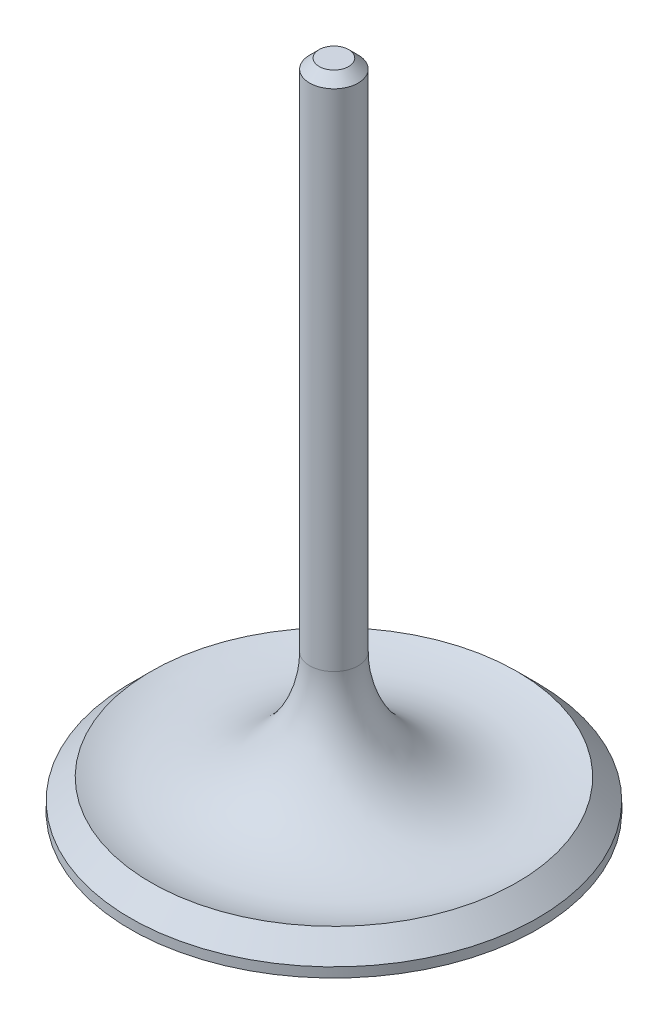
ISO-10303-21;
HEADER;
FILE_DESCRIPTION(('STEP AP214'),'2;1');
FILE_NAME('part.step','',(''),(''),'','','');
FILE_SCHEMA(('AUTOMOTIVE_DESIGN { 1 0 10303 214 1 1 1 1 }'));
ENDSEC;
DATA;
#1=APPLICATION_CONTEXT('core data for automotive mechanical design processes');
#2=APPLICATION_PROTOCOL_DEFINITION('international standard','automotive_design',2000,#1);
#3=PRODUCT_CONTEXT('',#1,'mechanical');
#4=PRODUCT('Part','Part','',(#3));
#5=PRODUCT_RELATED_PRODUCT_CATEGORY('part','',(#4));
#6=PRODUCT_DEFINITION_FORMATION('','',#4);
#7=PRODUCT_DEFINITION_CONTEXT('part definition',#1,'design');
#8=PRODUCT_DEFINITION('design','',#6,#7);
#9=PRODUCT_DEFINITION_SHAPE('','',#8);
#10=(LENGTH_UNIT() NAMED_UNIT(*) SI_UNIT(.MILLI.,.METRE.));
#11=(NAMED_UNIT(*) PLANE_ANGLE_UNIT() SI_UNIT($,.RADIAN.));
#12=(NAMED_UNIT(*) SI_UNIT($,.STERADIAN.) SOLID_ANGLE_UNIT());
#13=UNCERTAINTY_MEASURE_WITH_UNIT(LENGTH_MEASURE(1.E-05),#10,'distance_accuracy_value','');
#14=(GEOMETRIC_REPRESENTATION_CONTEXT(3) GLOBAL_UNCERTAINTY_ASSIGNED_CONTEXT((#13)) GLOBAL_UNIT_ASSIGNED_CONTEXT((#10,
#11,#12)) REPRESENTATION_CONTEXT('',''));
#15=CARTESIAN_POINT('',(0.,0.,0.));
#16=DIRECTION('',(0.,0.,1.));
#17=DIRECTION('',(1.,0.,0.));
#18=AXIS2_PLACEMENT_3D('',#15,#16,#17);
#19=CARTESIAN_POINT('',(0.,0.,-26.67));
#20=DIRECTION('',(0.,-1.,0.));
#21=DIRECTION('',(0.,0.,-1.));
#22=AXIS2_PLACEMENT_3D('',#19,#20,#21);
#23=PLANE('',#22);
#24=CARTESIAN_POINT('',(0.,0.,0.));
#25=DIRECTION('',(0.,-1.,0.));
#26=DIRECTION('',(0.,0.,-1.));
#27=AXIS2_PLACEMENT_3D('',#24,#25,#26);
#28=CIRCLE('',#27,26.67);
#29=CARTESIAN_POINT('',(0.,0.,-26.67));
#30=VERTEX_POINT('',#29);
#31=EDGE_CURVE('E57',#30,#30,#28,.T.);
#32=ORIENTED_EDGE('',*,*,#31,.T.);
#33=EDGE_LOOP('',(#32));
#34=FACE_BOUND('',#33,.T.);
#35=ADVANCED_FACE('F43',(#34),#23,.T.);
#36=CARTESIAN_POINT('',(0.,0.,0.));
#37=DIRECTION('',(0.,-1.,0.));
#38=DIRECTION('',(0.,0.,-1.));
#39=AXIS2_PLACEMENT_3D('',#36,#37,#38);
#40=CYLINDRICAL_SURFACE('',#39,26.67);
#41=CARTESIAN_POINT('',(0.,1.27,0.));
#42=DIRECTION('',(0.,-1.,0.));
#43=DIRECTION('',(0.,0.,-1.));
#44=AXIS2_PLACEMENT_3D('',#41,#42,#43);
#45=CIRCLE('',#44,26.67);
#46=CARTESIAN_POINT('',(0.,1.27,-26.67));
#47=VERTEX_POINT('',#46);
#48=EDGE_CURVE('E62',#47,#47,#45,.T.);
#49=ORIENTED_EDGE('',*,*,#48,.T.);
#50=EDGE_LOOP('',(#49));
#51=FACE_BOUND('',#50,.T.);
#52=ORIENTED_EDGE('',*,*,#31,.F.);
#53=EDGE_LOOP('',(#52));
#54=FACE_BOUND('',#53,.T.);
#55=ADVANCED_FACE('F92',(#51,#54),#40,.T.);
#56=CARTESIAN_POINT('',(0.,1.27,0.));
#57=DIRECTION('',(0.,-1.,0.));
#58=DIRECTION('',(0.,0.,-1.));
#59=AXIS2_PLACEMENT_3D('',#56,#57,#58);
#60=CONICAL_SURFACE('',#59,26.67,0.785398163397456);
#61=CARTESIAN_POINT('',(0.,3.96407683632073,0.));
#62=DIRECTION('',(0.,-1.,0.));
#63=DIRECTION('',(0.,0.,-1.));
#64=AXIS2_PLACEMENT_3D('',#61,#62,#63);
#65=CIRCLE('',#64,23.9759231636792);
#66=CARTESIAN_POINT('',(0.,3.96407683632073,-23.9759231636792));
#67=VERTEX_POINT('',#66);
#68=EDGE_CURVE('E68',#67,#67,#65,.T.);
#69=ORIENTED_EDGE('',*,*,#68,.T.);
#70=EDGE_LOOP('',(#69));
#71=FACE_BOUND('',#70,.T.);
#72=ORIENTED_EDGE('',*,*,#48,.F.);
#73=EDGE_LOOP('',(#72));
#74=FACE_BOUND('',#73,.T.);
#75=ADVANCED_FACE('F89',(#71,#74),#60,.T.);
#76=CARTESIAN_POINT('',(0.,18.1698938231246,0.));
#77=DIRECTION('',(0.,-1.,0.));
#78=DIRECTION('',(0.,0.,-1.));
#79=AXIS2_PLACEMENT_3D('',#76,#77,#78);
#80=TOROIDAL_SURFACE('',#79,18.43,15.25);
#81=CARTESIAN_POINT('',(0.,18.1698938231246,0.));
#82=DIRECTION('',(0.,-1.,0.));
#83=DIRECTION('',(0.,0.,-1.));
#84=AXIS2_PLACEMENT_3D('',#81,#82,#83);
#85=CIRCLE('',#84,3.18000000000001);
#86=CARTESIAN_POINT('',(0.,18.1698938231246,-3.18000000000001));
#87=VERTEX_POINT('',#86);
#88=EDGE_CURVE('E72',#87,#87,#85,.T.);
#89=ORIENTED_EDGE('',*,*,#88,.T.);
#90=EDGE_LOOP('',(#89));
#91=FACE_BOUND('',#90,.T.);
#92=ORIENTED_EDGE('',*,*,#68,.F.);
#93=EDGE_LOOP('',(#92));
#94=FACE_BOUND('',#93,.T.);
#95=ADVANCED_FACE('F77',(#91,#94),#80,.F.);
#96=CARTESIAN_POINT('',(0.,0.,0.));
#97=DIRECTION('',(0.,-1.,0.));
#98=DIRECTION('',(0.,0.,-1.));
#99=AXIS2_PLACEMENT_3D('',#96,#97,#98);
#100=CYLINDRICAL_SURFACE('',#99,3.18000000000001);
#101=CARTESIAN_POINT('',(0.,84.3,0.));
#102=DIRECTION('',(0.,1.,0.));
#103=DIRECTION('',(0.,0.,1.));
#104=AXIS2_PLACEMENT_3D('',#101,#102,#103);
#105=CIRCLE('',#104,3.18000000000001);
#106=CARTESIAN_POINT('',(0.,84.3,3.18000000000001));
#107=VERTEX_POINT('',#106);
#108=EDGE_CURVE('E52',#107,#107,#105,.F.);
#109=ORIENTED_EDGE('',*,*,#108,.T.);
#110=EDGE_LOOP('',(#109));
#111=FACE_BOUND('',#110,.T.);
#112=ORIENTED_EDGE('',*,*,#88,.F.);
#113=EDGE_LOOP('',(#112));
#114=FACE_BOUND('',#113,.T.);
#115=ADVANCED_FACE('F80',(#111,#114),#100,.T.);
#116=CARTESIAN_POINT('',(0.,85.55,0.));
#117=DIRECTION('',(0.,1.,0.));
#118=DIRECTION('',(0.,0.,1.));
#119=AXIS2_PLACEMENT_3D('',#116,#117,#118);
#120=PLANE('',#119);
#121=CARTESIAN_POINT('',(0.,85.55,0.));
#122=DIRECTION('',(0.,1.,0.));
#123=DIRECTION('',(0.,0.,1.));
#124=AXIS2_PLACEMENT_3D('',#121,#122,#123);
#125=CIRCLE('',#124,1.93000000000002);
#126=CARTESIAN_POINT('',(0.,85.55,1.93000000000002));
#127=VERTEX_POINT('',#126);
#128=EDGE_CURVE('E10',#127,#127,#125,.T.);
#129=ORIENTED_EDGE('',*,*,#128,.T.);
#130=EDGE_LOOP('',(#129));
#131=FACE_BOUND('',#130,.T.);
#132=ADVANCED_FACE('F82',(#131),#120,.T.);
#133=CARTESIAN_POINT('',(0.,84.3,0.));
#134=DIRECTION('',(0.,-1.,0.));
#135=DIRECTION('',(0.,0.,-1.));
#136=AXIS2_PLACEMENT_3D('',#133,#134,#135);
#137=CONICAL_SURFACE('',#136,3.18000000000001,0.785398163397444);
#138=ORIENTED_EDGE('',*,*,#128,.F.);
#139=EDGE_LOOP('',(#138));
#140=FACE_BOUND('',#139,.T.);
#141=ORIENTED_EDGE('',*,*,#108,.F.);
#142=EDGE_LOOP('',(#141));
#143=FACE_BOUND('',#142,.T.);
#144=ADVANCED_FACE('F46',(#140,#143),#137,.T.);
#145=CLOSED_SHELL('',(#35,#55,#75,#95,#115,#132,#144));
#146=MANIFOLD_SOLID_BREP('B2',#145);
#147=ADVANCED_BREP_SHAPE_REPRESENTATION('',(#18,#146),#14);
#148=SHAPE_DEFINITION_REPRESENTATION(#9,#147);
ENDSEC;
END-ISO-10303-21;
